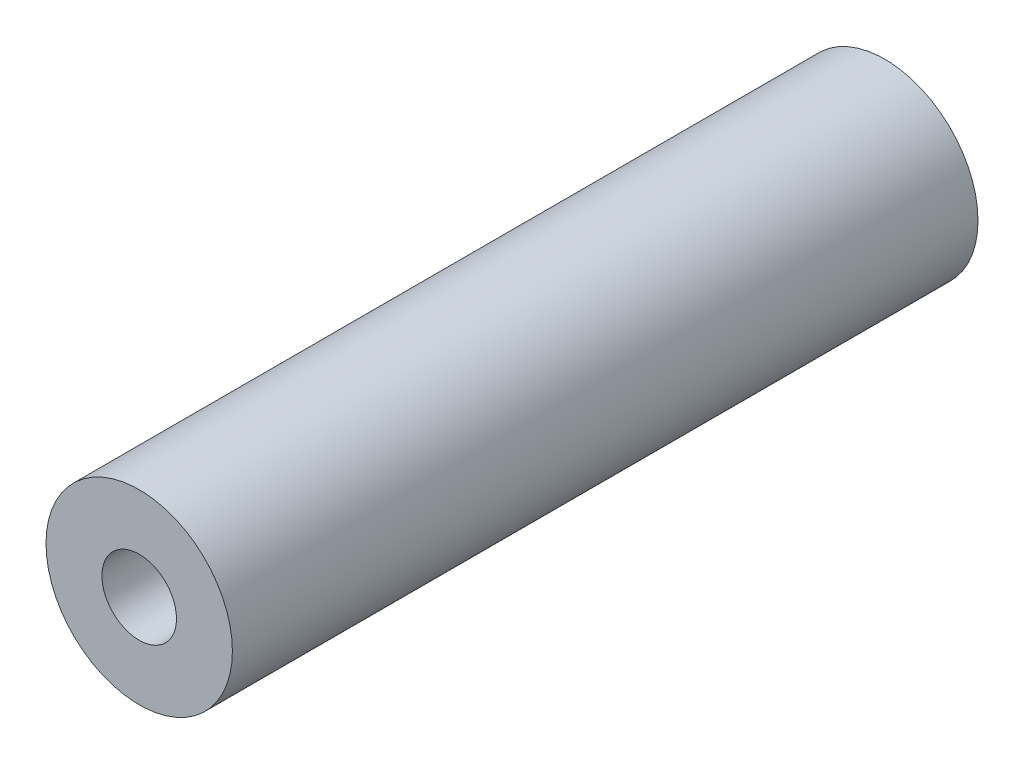
ISO-10303-21;
HEADER;
FILE_DESCRIPTION(('STEP AP214'),'2;1');
FILE_NAME('part.step','',(''),(''),'','','');
FILE_SCHEMA(('AUTOMOTIVE_DESIGN { 1 0 10303 214 1 1 1 1 }'));
ENDSEC;
DATA;
#1=APPLICATION_CONTEXT('core data for automotive mechanical design processes');
#2=APPLICATION_PROTOCOL_DEFINITION('international standard','automotive_design',2000,#1);
#3=PRODUCT_CONTEXT('',#1,'mechanical');
#4=PRODUCT('Part','Part','',(#3));
#5=PRODUCT_RELATED_PRODUCT_CATEGORY('part','',(#4));
#6=PRODUCT_DEFINITION_FORMATION('','',#4);
#7=PRODUCT_DEFINITION_CONTEXT('part definition',#1,'design');
#8=PRODUCT_DEFINITION('design','',#6,#7);
#9=PRODUCT_DEFINITION_SHAPE('','',#8);
#10=(LENGTH_UNIT() NAMED_UNIT(*) SI_UNIT(.MILLI.,.METRE.));
#11=(NAMED_UNIT(*) PLANE_ANGLE_UNIT() SI_UNIT($,.RADIAN.));
#12=(NAMED_UNIT(*) SI_UNIT($,.STERADIAN.) SOLID_ANGLE_UNIT());
#13=UNCERTAINTY_MEASURE_WITH_UNIT(LENGTH_MEASURE(1.E-05),#10,'distance_accuracy_value','');
#14=(GEOMETRIC_REPRESENTATION_CONTEXT(3) GLOBAL_UNCERTAINTY_ASSIGNED_CONTEXT((#13)) GLOBAL_UNIT_ASSIGNED_CONTEXT((#10,
#11,#12)) REPRESENTATION_CONTEXT('',''));
#15=CARTESIAN_POINT('',(0.,0.,0.));
#16=DIRECTION('',(0.,0.,1.));
#17=DIRECTION('',(1.,0.,0.));
#18=AXIS2_PLACEMENT_3D('',#15,#16,#17);
#19=CARTESIAN_POINT('',(0.,0.,40.));
#20=DIRECTION('',(0.,0.,1.));
#21=DIRECTION('',(1.,0.,0.));
#22=AXIS2_PLACEMENT_3D('',#19,#20,#21);
#23=PLANE('',#22);
#24=CARTESIAN_POINT('',(0.,0.,40.));
#25=DIRECTION('',(0.,0.,1.));
#26=DIRECTION('',(1.,0.,0.));
#27=AXIS2_PLACEMENT_3D('',#24,#25,#26);
#28=CIRCLE('',#27,5.);
#29=CARTESIAN_POINT('',(5.,0.,40.));
#30=VERTEX_POINT('',#29);
#31=EDGE_CURVE('E10',#30,#30,#28,.T.);
#32=ORIENTED_EDGE('',*,*,#31,.T.);
#33=EDGE_LOOP('',(#32));
#34=FACE_BOUND('',#33,.T.);
#35=CARTESIAN_POINT('',(0.,0.,40.));
#36=DIRECTION('',(0.,0.,1.));
#37=DIRECTION('',(1.,0.,0.));
#38=AXIS2_PLACEMENT_3D('',#35,#36,#37);
#39=CIRCLE('',#38,2.);
#40=CARTESIAN_POINT('',(2.,0.,40.));
#41=VERTEX_POINT('',#40);
#42=EDGE_CURVE('E50',#41,#41,#39,.T.);
#43=ORIENTED_EDGE('',*,*,#42,.F.);
#44=EDGE_LOOP('',(#43));
#45=FACE_BOUND('',#44,.T.);
#46=ADVANCED_FACE('F37',(#34,#45),#23,.T.);
#47=CARTESIAN_POINT('',(0.,0.,0.));
#48=DIRECTION('',(0.,0.,1.));
#49=DIRECTION('',(1.,0.,0.));
#50=AXIS2_PLACEMENT_3D('',#47,#48,#49);
#51=PLANE('',#50);
#52=CARTESIAN_POINT('',(0.,0.,0.));
#53=DIRECTION('',(0.,0.,1.));
#54=DIRECTION('',(1.,0.,0.));
#55=AXIS2_PLACEMENT_3D('',#52,#53,#54);
#56=CIRCLE('',#55,5.);
#57=CARTESIAN_POINT('',(5.,0.,0.));
#58=VERTEX_POINT('',#57);
#59=EDGE_CURVE('E41',#58,#58,#56,.T.);
#60=ORIENTED_EDGE('',*,*,#59,.F.);
#61=EDGE_LOOP('',(#60));
#62=FACE_BOUND('',#61,.T.);
#63=CARTESIAN_POINT('',(0.,0.,0.));
#64=DIRECTION('',(0.,0.,1.));
#65=DIRECTION('',(1.,0.,0.));
#66=AXIS2_PLACEMENT_3D('',#63,#64,#65);
#67=CIRCLE('',#66,2.);
#68=CARTESIAN_POINT('',(2.,0.,0.));
#69=VERTEX_POINT('',#68);
#70=EDGE_CURVE('E52',#69,#69,#67,.T.);
#71=ORIENTED_EDGE('',*,*,#70,.T.);
#72=EDGE_LOOP('',(#71));
#73=FACE_BOUND('',#72,.T.);
#74=ADVANCED_FACE('F64',(#62,#73),#51,.F.);
#75=CARTESIAN_POINT('',(0.,0.,40.));
#76=DIRECTION('',(0.,0.,-1.));
#77=DIRECTION('',(-1.,0.,0.));
#78=AXIS2_PLACEMENT_3D('',#75,#76,#77);
#79=CYLINDRICAL_SURFACE('',#78,5.);
#80=ORIENTED_EDGE('',*,*,#31,.F.);
#81=EDGE_LOOP('',(#80));
#82=FACE_BOUND('',#81,.T.);
#83=ORIENTED_EDGE('',*,*,#59,.T.);
#84=EDGE_LOOP('',(#83));
#85=FACE_BOUND('',#84,.T.);
#86=ADVANCED_FACE('F39',(#82,#85),#79,.T.);
#87=CARTESIAN_POINT('',(0.,0.,40.));
#88=DIRECTION('',(0.,0.,-1.));
#89=DIRECTION('',(-1.,0.,0.));
#90=AXIS2_PLACEMENT_3D('',#87,#88,#89);
#91=CYLINDRICAL_SURFACE('',#90,2.);
#92=ORIENTED_EDGE('',*,*,#42,.T.);
#93=EDGE_LOOP('',(#92));
#94=FACE_BOUND('',#93,.T.);
#95=ORIENTED_EDGE('',*,*,#70,.F.);
#96=EDGE_LOOP('',(#95));
#97=FACE_BOUND('',#96,.T.);
#98=ADVANCED_FACE('F60',(#94,#97),#91,.F.);
#99=CLOSED_SHELL('',(#46,#74,#86,#98));
#100=MANIFOLD_SOLID_BREP('B2',#99);
#101=ADVANCED_BREP_SHAPE_REPRESENTATION('',(#18,#100),#14);
#102=SHAPE_DEFINITION_REPRESENTATION(#9,#101);
ENDSEC;
END-ISO-10303-21;
